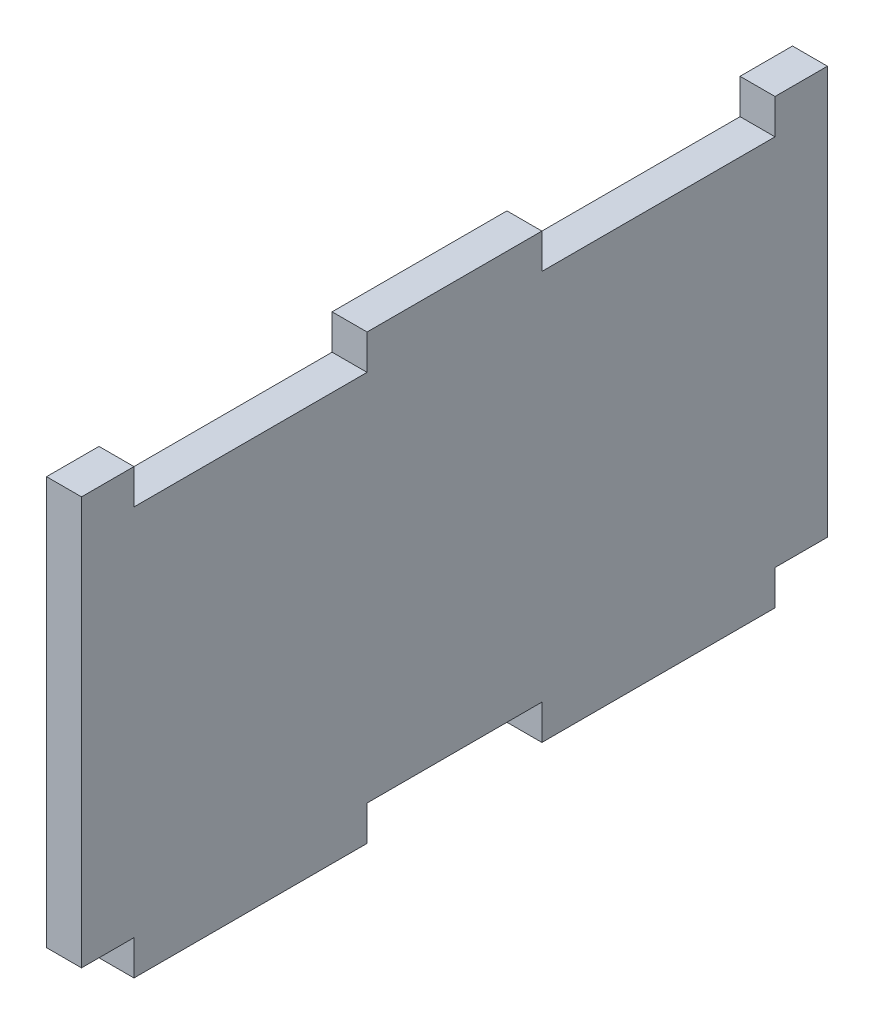
ISO-10303-21;
HEADER;
FILE_DESCRIPTION(('STEP AP214'),'2;1');
FILE_NAME('part.step','',(''),(''),'','','');
FILE_SCHEMA(('AUTOMOTIVE_DESIGN { 1 0 10303 214 1 1 1 1 }'));
ENDSEC;
DATA;
#1=APPLICATION_CONTEXT('core data for automotive mechanical design processes');
#2=APPLICATION_PROTOCOL_DEFINITION('international standard','automotive_design',2000,#1);
#3=PRODUCT_CONTEXT('',#1,'mechanical');
#4=PRODUCT('Part','Part','',(#3));
#5=PRODUCT_RELATED_PRODUCT_CATEGORY('part','',(#4));
#6=PRODUCT_DEFINITION_FORMATION('','',#4);
#7=PRODUCT_DEFINITION_CONTEXT('part definition',#1,'design');
#8=PRODUCT_DEFINITION('design','',#6,#7);
#9=PRODUCT_DEFINITION_SHAPE('','',#8);
#10=(LENGTH_UNIT() NAMED_UNIT(*) SI_UNIT(.MILLI.,.METRE.));
#11=(NAMED_UNIT(*) PLANE_ANGLE_UNIT() SI_UNIT($,.RADIAN.));
#12=(NAMED_UNIT(*) SI_UNIT($,.STERADIAN.) SOLID_ANGLE_UNIT());
#13=UNCERTAINTY_MEASURE_WITH_UNIT(LENGTH_MEASURE(1.E-05),#10,'distance_accuracy_value','');
#14=(GEOMETRIC_REPRESENTATION_CONTEXT(3) GLOBAL_UNCERTAINTY_ASSIGNED_CONTEXT((#13)) GLOBAL_UNIT_ASSIGNED_CONTEXT((#10,
#11,#12)) REPRESENTATION_CONTEXT('',''));
#15=CARTESIAN_POINT('',(0.,0.,0.));
#16=DIRECTION('',(0.,0.,1.));
#17=DIRECTION('',(1.,0.,0.));
#18=AXIS2_PLACEMENT_3D('',#15,#16,#17);
#19=CARTESIAN_POINT('',(3.,0.,0.));
#20=DIRECTION('',(0.,0.,1.));
#21=DIRECTION('',(1.,0.,0.));
#22=AXIS2_PLACEMENT_3D('',#19,#20,#21);
#23=PLANE('',#22);
#24=DIRECTION('',(0.,1.,0.));
#25=VECTOR('',#24,1.);
#26=CARTESIAN_POINT('',(0.,0.,0.));
#27=LINE('',#26,#25);
#28=CARTESIAN_POINT('',(0.,0.,0.));
#29=VERTEX_POINT('',#28);
#30=CARTESIAN_POINT('',(0.,35.,0.));
#31=VERTEX_POINT('',#30);
#32=EDGE_CURVE('E206',#29,#31,#27,.T.);
#33=ORIENTED_EDGE('',*,*,#32,.F.);
#34=DIRECTION('',(-1.,0.,0.));
#35=VECTOR('',#34,1.);
#36=CARTESIAN_POINT('',(3.,0.,0.));
#37=LINE('',#36,#35);
#38=CARTESIAN_POINT('',(3.,0.,0.));
#39=VERTEX_POINT('',#38);
#40=EDGE_CURVE('E42',#39,#29,#37,.T.);
#41=ORIENTED_EDGE('',*,*,#40,.F.);
#42=DIRECTION('',(0.,1.,0.));
#43=VECTOR('',#42,1.);
#44=CARTESIAN_POINT('',(3.,0.,0.));
#45=LINE('',#44,#43);
#46=CARTESIAN_POINT('',(3.,35.,0.));
#47=VERTEX_POINT('',#46);
#48=EDGE_CURVE('E257',#39,#47,#45,.T.);
#49=ORIENTED_EDGE('',*,*,#48,.T.);
#50=DIRECTION('',(-1.,0.,0.));
#51=VECTOR('',#50,1.);
#52=CARTESIAN_POINT('',(3.,35.,0.));
#53=LINE('',#52,#51);
#54=EDGE_CURVE('E124',#47,#31,#53,.T.);
#55=ORIENTED_EDGE('',*,*,#54,.T.);
#56=EDGE_LOOP('',(#33,#41,#49,#55));
#57=FACE_BOUND('',#56,.T.);
#58=ADVANCED_FACE('F35',(#57),#23,.T.);
#59=CARTESIAN_POINT('',(3.,0.,0.));
#60=DIRECTION('',(0.,1.,0.));
#61=DIRECTION('',(0.,0.,1.));
#62=AXIS2_PLACEMENT_3D('',#59,#60,#61);
#63=PLANE('',#62);
#64=DIRECTION('',(0.,0.,-1.));
#65=VECTOR('',#64,1.);
#66=CARTESIAN_POINT('',(0.,0.,0.));
#67=LINE('',#66,#65);
#68=CARTESIAN_POINT('',(0.,0.,-4.5));
#69=VERTEX_POINT('',#68);
#70=EDGE_CURVE('E255',#29,#69,#67,.T.);
#71=ORIENTED_EDGE('',*,*,#70,.T.);
#72=DIRECTION('',(-1.,0.,0.));
#73=VECTOR('',#72,1.);
#74=CARTESIAN_POINT('',(3.,0.,-4.5));
#75=LINE('',#74,#73);
#76=CARTESIAN_POINT('',(3.,0.,-4.5));
#77=VERTEX_POINT('',#76);
#78=EDGE_CURVE('E194',#77,#69,#75,.T.);
#79=ORIENTED_EDGE('',*,*,#78,.F.);
#80=DIRECTION('',(0.,0.,-1.));
#81=VECTOR('',#80,1.);
#82=CARTESIAN_POINT('',(3.,0.,0.));
#83=LINE('',#82,#81);
#84=EDGE_CURVE('E181',#39,#77,#83,.T.);
#85=ORIENTED_EDGE('',*,*,#84,.F.);
#86=ORIENTED_EDGE('',*,*,#40,.T.);
#87=EDGE_LOOP('',(#71,#79,#85,#86));
#88=FACE_BOUND('',#87,.T.);
#89=ADVANCED_FACE('F292',(#88),#63,.F.);
#90=CARTESIAN_POINT('',(3.,0.,-4.5));
#91=DIRECTION('',(0.,0.,-1.));
#92=DIRECTION('',(0.,1.,0.));
#93=AXIS2_PLACEMENT_3D('',#90,#91,#92);
#94=PLANE('',#93);
#95=DIRECTION('',(0.,-1.,0.));
#96=VECTOR('',#95,1.);
#97=CARTESIAN_POINT('',(0.,0.,-4.5));
#98=LINE('',#97,#96);
#99=CARTESIAN_POINT('',(0.,-3.,-4.50000000000001));
#100=VERTEX_POINT('',#99);
#101=EDGE_CURVE('E190',#69,#100,#98,.T.);
#102=ORIENTED_EDGE('',*,*,#101,.T.);
#103=DIRECTION('',(-1.,0.,0.));
#104=VECTOR('',#103,1.);
#105=CARTESIAN_POINT('',(3.,-3.,-4.50000000000001));
#106=LINE('',#105,#104);
#107=CARTESIAN_POINT('',(3.,-3.,-4.50000000000001));
#108=VERTEX_POINT('',#107);
#109=EDGE_CURVE('E187',#108,#100,#106,.T.);
#110=ORIENTED_EDGE('',*,*,#109,.F.);
#111=DIRECTION('',(0.,-1.,0.));
#112=VECTOR('',#111,1.);
#113=CARTESIAN_POINT('',(3.,0.,-4.5));
#114=LINE('',#113,#112);
#115=EDGE_CURVE('E172',#77,#108,#114,.T.);
#116=ORIENTED_EDGE('',*,*,#115,.F.);
#117=ORIENTED_EDGE('',*,*,#78,.T.);
#118=EDGE_LOOP('',(#102,#110,#116,#117));
#119=FACE_BOUND('',#118,.T.);
#120=ADVANCED_FACE('F188',(#119),#94,.F.);
#121=CARTESIAN_POINT('',(3.,-3.,-4.50000000000001));
#122=DIRECTION('',(0.,1.,0.));
#123=DIRECTION('',(0.,0.,1.));
#124=AXIS2_PLACEMENT_3D('',#121,#122,#123);
#125=PLANE('',#124);
#126=DIRECTION('',(0.,0.,-1.));
#127=VECTOR('',#126,1.);
#128=CARTESIAN_POINT('',(0.,-3.,-4.50000000000001));
#129=LINE('',#128,#127);
#130=CARTESIAN_POINT('',(0.,-3.,-24.5));
#131=VERTEX_POINT('',#130);
#132=EDGE_CURVE('E252',#100,#131,#129,.T.);
#133=ORIENTED_EDGE('',*,*,#132,.T.);
#134=DIRECTION('',(-1.,0.,0.));
#135=VECTOR('',#134,1.);
#136=CARTESIAN_POINT('',(3.,-3.,-24.5));
#137=LINE('',#136,#135);
#138=CARTESIAN_POINT('',(3.,-3.,-24.5));
#139=VERTEX_POINT('',#138);
#140=EDGE_CURVE('E195',#139,#131,#137,.T.);
#141=ORIENTED_EDGE('',*,*,#140,.F.);
#142=DIRECTION('',(0.,0.,-1.));
#143=VECTOR('',#142,1.);
#144=CARTESIAN_POINT('',(3.,-3.,-4.50000000000001));
#145=LINE('',#144,#143);
#146=EDGE_CURVE('E178',#108,#139,#145,.T.);
#147=ORIENTED_EDGE('',*,*,#146,.F.);
#148=ORIENTED_EDGE('',*,*,#109,.T.);
#149=EDGE_LOOP('',(#133,#141,#147,#148));
#150=FACE_BOUND('',#149,.T.);
#151=ADVANCED_FACE('F197',(#150),#125,.F.);
#152=CARTESIAN_POINT('',(3.,0.,-24.5));
#153=DIRECTION('',(0.,0.,-1.));
#154=DIRECTION('',(0.,1.,0.));
#155=AXIS2_PLACEMENT_3D('',#152,#153,#154);
#156=PLANE('',#155);
#157=DIRECTION('',(0.,-1.,0.));
#158=VECTOR('',#157,1.);
#159=CARTESIAN_POINT('',(0.,0.,-24.5));
#160=LINE('',#159,#158);
#161=CARTESIAN_POINT('',(0.,0.,-24.5));
#162=VERTEX_POINT('',#161);
#163=EDGE_CURVE('E249',#162,#131,#160,.T.);
#164=ORIENTED_EDGE('',*,*,#163,.F.);
#165=DIRECTION('',(-1.,0.,0.));
#166=VECTOR('',#165,1.);
#167=CARTESIAN_POINT('',(3.,0.,-24.5));
#168=LINE('',#167,#166);
#169=CARTESIAN_POINT('',(3.,0.,-24.5));
#170=VERTEX_POINT('',#169);
#171=EDGE_CURVE('E261',#170,#162,#168,.T.);
#172=ORIENTED_EDGE('',*,*,#171,.F.);
#173=DIRECTION('',(0.,-1.,0.));
#174=VECTOR('',#173,1.);
#175=CARTESIAN_POINT('',(3.,0.,-24.5));
#176=LINE('',#175,#174);
#177=EDGE_CURVE('E199',#170,#139,#176,.T.);
#178=ORIENTED_EDGE('',*,*,#177,.T.);
#179=ORIENTED_EDGE('',*,*,#140,.T.);
#180=EDGE_LOOP('',(#164,#172,#178,#179));
#181=FACE_BOUND('',#180,.T.);
#182=ADVANCED_FACE('F417',(#181),#156,.T.);
#183=CARTESIAN_POINT('',(3.,0.,-24.5));
#184=DIRECTION('',(0.,1.,0.));
#185=DIRECTION('',(0.,0.,1.));
#186=AXIS2_PLACEMENT_3D('',#183,#184,#185);
#187=PLANE('',#186);
#188=DIRECTION('',(0.,0.,-1.));
#189=VECTOR('',#188,1.);
#190=CARTESIAN_POINT('',(0.,0.,-24.5));
#191=LINE('',#190,#189);
#192=CARTESIAN_POINT('',(0.,0.,-39.5));
#193=VERTEX_POINT('',#192);
#194=EDGE_CURVE('E247',#162,#193,#191,.T.);
#195=ORIENTED_EDGE('',*,*,#194,.T.);
#196=DIRECTION('',(-1.,0.,0.));
#197=VECTOR('',#196,1.);
#198=CARTESIAN_POINT('',(3.,0.,-39.5));
#199=LINE('',#198,#197);
#200=CARTESIAN_POINT('',(3.,0.,-39.5));
#201=VERTEX_POINT('',#200);
#202=EDGE_CURVE('E263',#201,#193,#199,.T.);
#203=ORIENTED_EDGE('',*,*,#202,.F.);
#204=DIRECTION('',(0.,0.,-1.));
#205=VECTOR('',#204,1.);
#206=CARTESIAN_POINT('',(3.,0.,-24.5));
#207=LINE('',#206,#205);
#208=EDGE_CURVE('E201',#170,#201,#207,.T.);
#209=ORIENTED_EDGE('',*,*,#208,.F.);
#210=ORIENTED_EDGE('',*,*,#171,.T.);
#211=EDGE_LOOP('',(#195,#203,#209,#210));
#212=FACE_BOUND('',#211,.T.);
#213=ADVANCED_FACE('F335',(#212),#187,.F.);
#214=CARTESIAN_POINT('',(3.,0.,-39.5));
#215=DIRECTION('',(0.,0.,-1.));
#216=DIRECTION('',(0.,1.,0.));
#217=AXIS2_PLACEMENT_3D('',#214,#215,#216);
#218=PLANE('',#217);
#219=DIRECTION('',(0.,-1.,0.));
#220=VECTOR('',#219,1.);
#221=CARTESIAN_POINT('',(0.,0.,-39.5));
#222=LINE('',#221,#220);
#223=CARTESIAN_POINT('',(0.,-3.,-39.5));
#224=VERTEX_POINT('',#223);
#225=EDGE_CURVE('E245',#193,#224,#222,.T.);
#226=ORIENTED_EDGE('',*,*,#225,.T.);
#227=DIRECTION('',(-1.,0.,0.));
#228=VECTOR('',#227,1.);
#229=CARTESIAN_POINT('',(3.,-3.,-39.5));
#230=LINE('',#229,#228);
#231=CARTESIAN_POINT('',(3.,-3.,-39.5));
#232=VERTEX_POINT('',#231);
#233=EDGE_CURVE('E266',#232,#224,#230,.T.);
#234=ORIENTED_EDGE('',*,*,#233,.F.);
#235=DIRECTION('',(0.,-1.,0.));
#236=VECTOR('',#235,1.);
#237=CARTESIAN_POINT('',(3.,0.,-39.5));
#238=LINE('',#237,#236);
#239=EDGE_CURVE('E329',#201,#232,#238,.T.);
#240=ORIENTED_EDGE('',*,*,#239,.F.);
#241=ORIENTED_EDGE('',*,*,#202,.T.);
#242=EDGE_LOOP('',(#226,#234,#240,#241));
#243=FACE_BOUND('',#242,.T.);
#244=ADVANCED_FACE('F339',(#243),#218,.F.);
#245=CARTESIAN_POINT('',(3.,-3.,-39.5));
#246=DIRECTION('',(0.,1.,0.));
#247=DIRECTION('',(0.,0.,1.));
#248=AXIS2_PLACEMENT_3D('',#245,#246,#247);
#249=PLANE('',#248);
#250=DIRECTION('',(0.,0.,-1.));
#251=VECTOR('',#250,1.);
#252=CARTESIAN_POINT('',(0.,-3.,-39.5));
#253=LINE('',#252,#251);
#254=CARTESIAN_POINT('',(0.,-3.,-59.5));
#255=VERTEX_POINT('',#254);
#256=EDGE_CURVE('E242',#224,#255,#253,.T.);
#257=ORIENTED_EDGE('',*,*,#256,.T.);
#258=DIRECTION('',(-1.,0.,0.));
#259=VECTOR('',#258,1.);
#260=CARTESIAN_POINT('',(3.,-3.,-59.5));
#261=LINE('',#260,#259);
#262=CARTESIAN_POINT('',(3.,-3.,-59.5));
#263=VERTEX_POINT('',#262);
#264=EDGE_CURVE('E269',#263,#255,#261,.T.);
#265=ORIENTED_EDGE('',*,*,#264,.F.);
#266=DIRECTION('',(0.,0.,-1.));
#267=VECTOR('',#266,1.);
#268=CARTESIAN_POINT('',(3.,-3.,-39.5));
#269=LINE('',#268,#267);
#270=EDGE_CURVE('E327',#232,#263,#269,.T.);
#271=ORIENTED_EDGE('',*,*,#270,.F.);
#272=ORIENTED_EDGE('',*,*,#233,.T.);
#273=EDGE_LOOP('',(#257,#265,#271,#272));
#274=FACE_BOUND('',#273,.T.);
#275=ADVANCED_FACE('F344',(#274),#249,.F.);
#276=CARTESIAN_POINT('',(3.,0.,-59.5));
#277=DIRECTION('',(0.,0.,-1.));
#278=DIRECTION('',(0.,1.,0.));
#279=AXIS2_PLACEMENT_3D('',#276,#277,#278);
#280=PLANE('',#279);
#281=DIRECTION('',(0.,-1.,0.));
#282=VECTOR('',#281,1.);
#283=CARTESIAN_POINT('',(0.,0.,-59.5));
#284=LINE('',#283,#282);
#285=CARTESIAN_POINT('',(0.,0.,-59.5));
#286=VERTEX_POINT('',#285);
#287=EDGE_CURVE('E239',#286,#255,#284,.T.);
#288=ORIENTED_EDGE('',*,*,#287,.F.);
#289=DIRECTION('',(-1.,0.,0.));
#290=VECTOR('',#289,1.);
#291=CARTESIAN_POINT('',(3.,0.,-59.5));
#292=LINE('',#291,#290);
#293=CARTESIAN_POINT('',(3.,0.,-59.5));
#294=VERTEX_POINT('',#293);
#295=EDGE_CURVE('E271',#294,#286,#292,.T.);
#296=ORIENTED_EDGE('',*,*,#295,.F.);
#297=DIRECTION('',(0.,-1.,0.));
#298=VECTOR('',#297,1.);
#299=CARTESIAN_POINT('',(3.,0.,-59.5));
#300=LINE('',#299,#298);
#301=EDGE_CURVE('E324',#294,#263,#300,.T.);
#302=ORIENTED_EDGE('',*,*,#301,.T.);
#303=ORIENTED_EDGE('',*,*,#264,.T.);
#304=EDGE_LOOP('',(#288,#296,#302,#303));
#305=FACE_BOUND('',#304,.T.);
#306=ADVANCED_FACE('F351',(#305),#280,.T.);
#307=CARTESIAN_POINT('',(3.,0.,-59.5));
#308=DIRECTION('',(0.,1.,0.));
#309=DIRECTION('',(0.,0.,1.));
#310=AXIS2_PLACEMENT_3D('',#307,#308,#309);
#311=PLANE('',#310);
#312=DIRECTION('',(0.,0.,-1.));
#313=VECTOR('',#312,1.);
#314=CARTESIAN_POINT('',(0.,0.,-59.5));
#315=LINE('',#314,#313);
#316=CARTESIAN_POINT('',(0.,0.,-64.));
#317=VERTEX_POINT('',#316);
#318=EDGE_CURVE('E236',#286,#317,#315,.T.);
#319=ORIENTED_EDGE('',*,*,#318,.T.);
#320=DIRECTION('',(1.,0.,0.));
#321=VECTOR('',#320,1.);
#322=CARTESIAN_POINT('',(3.,0.,-64.));
#323=LINE('',#322,#321);
#324=CARTESIAN_POINT('',(3.,0.,-64.));
#325=VERTEX_POINT('',#324);
#326=EDGE_CURVE('E48',#317,#325,#323,.T.);
#327=ORIENTED_EDGE('',*,*,#326,.T.);
#328=DIRECTION('',(0.,0.,-1.));
#329=VECTOR('',#328,1.);
#330=CARTESIAN_POINT('',(3.,0.,-59.5));
#331=LINE('',#330,#329);
#332=EDGE_CURVE('E322',#294,#325,#331,.T.);
#333=ORIENTED_EDGE('',*,*,#332,.F.);
#334=ORIENTED_EDGE('',*,*,#295,.T.);
#335=EDGE_LOOP('',(#319,#327,#333,#334));
#336=FACE_BOUND('',#335,.T.);
#337=ADVANCED_FACE('F354',(#336),#311,.F.);
#338=CARTESIAN_POINT('',(3.,35.,-59.5));
#339=DIRECTION('',(0.,1.,0.));
#340=DIRECTION('',(0.,0.,1.));
#341=AXIS2_PLACEMENT_3D('',#338,#339,#340);
#342=PLANE('',#341);
#343=DIRECTION('',(1.,0.,0.));
#344=VECTOR('',#343,1.);
#345=CARTESIAN_POINT('',(3.,35.,-64.));
#346=LINE('',#345,#344);
#347=CARTESIAN_POINT('',(0.,35.,-64.));
#348=VERTEX_POINT('',#347);
#349=CARTESIAN_POINT('',(3.,35.,-64.));
#350=VERTEX_POINT('',#349);
#351=EDGE_CURVE('E356',#348,#350,#346,.T.);
#352=ORIENTED_EDGE('',*,*,#351,.F.);
#353=DIRECTION('',(0.,0.,-1.));
#354=VECTOR('',#353,1.);
#355=CARTESIAN_POINT('',(0.,35.,-59.5));
#356=LINE('',#355,#354);
#357=CARTESIAN_POINT('',(0.,35.,-59.5));
#358=VERTEX_POINT('',#357);
#359=EDGE_CURVE('E233',#358,#348,#356,.T.);
#360=ORIENTED_EDGE('',*,*,#359,.F.);
#361=DIRECTION('',(-1.,0.,0.));
#362=VECTOR('',#361,1.);
#363=CARTESIAN_POINT('',(3.,35.,-59.5));
#364=LINE('',#363,#362);
#365=CARTESIAN_POINT('',(3.,35.,-59.5));
#366=VERTEX_POINT('',#365);
#367=EDGE_CURVE('E273',#366,#358,#364,.T.);
#368=ORIENTED_EDGE('',*,*,#367,.F.);
#369=DIRECTION('',(0.,0.,-1.));
#370=VECTOR('',#369,1.);
#371=CARTESIAN_POINT('',(3.,35.,-59.5));
#372=LINE('',#371,#370);
#373=EDGE_CURVE('E319',#366,#350,#372,.T.);
#374=ORIENTED_EDGE('',*,*,#373,.T.);
#375=EDGE_LOOP('',(#352,#360,#368,#374));
#376=FACE_BOUND('',#375,.T.);
#377=ADVANCED_FACE('F365',(#376),#342,.T.);
#378=CARTESIAN_POINT('',(3.,35.,-59.5));
#379=DIRECTION('',(0.,0.,-1.));
#380=DIRECTION('',(0.,1.,0.));
#381=AXIS2_PLACEMENT_3D('',#378,#379,#380);
#382=PLANE('',#381);
#383=DIRECTION('',(0.,-1.,0.));
#384=VECTOR('',#383,1.);
#385=CARTESIAN_POINT('',(0.,35.,-59.5));
#386=LINE('',#385,#384);
#387=CARTESIAN_POINT('',(0.,32.,-59.5));
#388=VERTEX_POINT('',#387);
#389=EDGE_CURVE('E230',#358,#388,#386,.T.);
#390=ORIENTED_EDGE('',*,*,#389,.T.);
#391=DIRECTION('',(-1.,0.,0.));
#392=VECTOR('',#391,1.);
#393=CARTESIAN_POINT('',(3.,32.,-59.5));
#394=LINE('',#393,#392);
#395=CARTESIAN_POINT('',(3.,32.,-59.5));
#396=VERTEX_POINT('',#395);
#397=EDGE_CURVE('E275',#396,#388,#394,.T.);
#398=ORIENTED_EDGE('',*,*,#397,.F.);
#399=DIRECTION('',(0.,-1.,0.));
#400=VECTOR('',#399,1.);
#401=CARTESIAN_POINT('',(3.,35.,-59.5));
#402=LINE('',#401,#400);
#403=EDGE_CURVE('E317',#366,#396,#402,.T.);
#404=ORIENTED_EDGE('',*,*,#403,.F.);
#405=ORIENTED_EDGE('',*,*,#367,.T.);
#406=EDGE_LOOP('',(#390,#398,#404,#405));
#407=FACE_BOUND('',#406,.T.);
#408=ADVANCED_FACE('F371',(#407),#382,.F.);
#409=CARTESIAN_POINT('',(3.,32.,-39.5));
#410=DIRECTION('',(0.,1.,0.));
#411=DIRECTION('',(0.,0.,1.));
#412=AXIS2_PLACEMENT_3D('',#409,#410,#411);
#413=PLANE('',#412);
#414=DIRECTION('',(0.,0.,-1.));
#415=VECTOR('',#414,1.);
#416=CARTESIAN_POINT('',(0.,32.,-39.5));
#417=LINE('',#416,#415);
#418=CARTESIAN_POINT('',(0.,32.,-39.5));
#419=VERTEX_POINT('',#418);
#420=EDGE_CURVE('E227',#419,#388,#417,.T.);
#421=ORIENTED_EDGE('',*,*,#420,.F.);
#422=DIRECTION('',(-1.,0.,0.));
#423=VECTOR('',#422,1.);
#424=CARTESIAN_POINT('',(3.,32.,-39.5));
#425=LINE('',#424,#423);
#426=CARTESIAN_POINT('',(3.,32.,-39.5));
#427=VERTEX_POINT('',#426);
#428=EDGE_CURVE('E277',#427,#419,#425,.T.);
#429=ORIENTED_EDGE('',*,*,#428,.F.);
#430=DIRECTION('',(0.,0.,-1.));
#431=VECTOR('',#430,1.);
#432=CARTESIAN_POINT('',(3.,32.,-39.5));
#433=LINE('',#432,#431);
#434=EDGE_CURVE('E314',#427,#396,#433,.T.);
#435=ORIENTED_EDGE('',*,*,#434,.T.);
#436=ORIENTED_EDGE('',*,*,#397,.T.);
#437=EDGE_LOOP('',(#421,#429,#435,#436));
#438=FACE_BOUND('',#437,.T.);
#439=ADVANCED_FACE('F394',(#438),#413,.T.);
#440=CARTESIAN_POINT('',(3.,35.,-39.5));
#441=DIRECTION('',(0.,0.,-1.));
#442=DIRECTION('',(0.,1.,0.));
#443=AXIS2_PLACEMENT_3D('',#440,#441,#442);
#444=PLANE('',#443);
#445=DIRECTION('',(0.,-1.,0.));
#446=VECTOR('',#445,1.);
#447=CARTESIAN_POINT('',(0.,35.,-39.5));
#448=LINE('',#447,#446);
#449=CARTESIAN_POINT('',(0.,35.,-39.5));
#450=VERTEX_POINT('',#449);
#451=EDGE_CURVE('E224',#450,#419,#448,.T.);
#452=ORIENTED_EDGE('',*,*,#451,.F.);
#453=DIRECTION('',(-1.,0.,0.));
#454=VECTOR('',#453,1.);
#455=CARTESIAN_POINT('',(3.,35.,-39.5));
#456=LINE('',#455,#454);
#457=CARTESIAN_POINT('',(3.,35.,-39.5));
#458=VERTEX_POINT('',#457);
#459=EDGE_CURVE('E279',#458,#450,#456,.T.);
#460=ORIENTED_EDGE('',*,*,#459,.F.);
#461=DIRECTION('',(0.,-1.,0.));
#462=VECTOR('',#461,1.);
#463=CARTESIAN_POINT('',(3.,35.,-39.5));
#464=LINE('',#463,#462);
#465=EDGE_CURVE('E311',#458,#427,#464,.T.);
#466=ORIENTED_EDGE('',*,*,#465,.T.);
#467=ORIENTED_EDGE('',*,*,#428,.T.);
#468=EDGE_LOOP('',(#452,#460,#466,#467));
#469=FACE_BOUND('',#468,.T.);
#470=ADVANCED_FACE('F378',(#469),#444,.T.);
#471=CARTESIAN_POINT('',(3.,35.,-24.5));
#472=DIRECTION('',(0.,1.,0.));
#473=DIRECTION('',(0.,0.,1.));
#474=AXIS2_PLACEMENT_3D('',#471,#472,#473);
#475=PLANE('',#474);
#476=DIRECTION('',(0.,0.,-1.));
#477=VECTOR('',#476,1.);
#478=CARTESIAN_POINT('',(0.,35.,-24.5));
#479=LINE('',#478,#477);
#480=CARTESIAN_POINT('',(0.,35.,-24.5));
#481=VERTEX_POINT('',#480);
#482=EDGE_CURVE('E221',#481,#450,#479,.T.);
#483=ORIENTED_EDGE('',*,*,#482,.F.);
#484=DIRECTION('',(-1.,0.,0.));
#485=VECTOR('',#484,1.);
#486=CARTESIAN_POINT('',(3.,35.,-24.5));
#487=LINE('',#486,#485);
#488=CARTESIAN_POINT('',(3.,35.,-24.5));
#489=VERTEX_POINT('',#488);
#490=EDGE_CURVE('E281',#489,#481,#487,.T.);
#491=ORIENTED_EDGE('',*,*,#490,.F.);
#492=DIRECTION('',(0.,0.,-1.));
#493=VECTOR('',#492,1.);
#494=CARTESIAN_POINT('',(3.,35.,-24.5));
#495=LINE('',#494,#493);
#496=EDGE_CURVE('E308',#489,#458,#495,.T.);
#497=ORIENTED_EDGE('',*,*,#496,.T.);
#498=ORIENTED_EDGE('',*,*,#459,.T.);
#499=EDGE_LOOP('',(#483,#491,#497,#498));
#500=FACE_BOUND('',#499,.T.);
#501=ADVANCED_FACE('F382',(#500),#475,.T.);
#502=CARTESIAN_POINT('',(3.,35.,-24.5));
#503=DIRECTION('',(0.,0.,-1.));
#504=DIRECTION('',(0.,1.,0.));
#505=AXIS2_PLACEMENT_3D('',#502,#503,#504);
#506=PLANE('',#505);
#507=DIRECTION('',(0.,-1.,0.));
#508=VECTOR('',#507,1.);
#509=CARTESIAN_POINT('',(0.,35.,-24.5));
#510=LINE('',#509,#508);
#511=CARTESIAN_POINT('',(0.,32.,-24.5));
#512=VERTEX_POINT('',#511);
#513=EDGE_CURVE('E218',#481,#512,#510,.T.);
#514=ORIENTED_EDGE('',*,*,#513,.T.);
#515=DIRECTION('',(-1.,0.,0.));
#516=VECTOR('',#515,1.);
#517=CARTESIAN_POINT('',(3.,32.,-24.5));
#518=LINE('',#517,#516);
#519=CARTESIAN_POINT('',(3.,32.,-24.5));
#520=VERTEX_POINT('',#519);
#521=EDGE_CURVE('E283',#520,#512,#518,.T.);
#522=ORIENTED_EDGE('',*,*,#521,.F.);
#523=DIRECTION('',(0.,-1.,0.));
#524=VECTOR('',#523,1.);
#525=CARTESIAN_POINT('',(3.,35.,-24.5));
#526=LINE('',#525,#524);
#527=EDGE_CURVE('E306',#489,#520,#526,.T.);
#528=ORIENTED_EDGE('',*,*,#527,.F.);
#529=ORIENTED_EDGE('',*,*,#490,.T.);
#530=EDGE_LOOP('',(#514,#522,#528,#529));
#531=FACE_BOUND('',#530,.T.);
#532=ADVANCED_FACE('F387',(#531),#506,.F.);
#533=CARTESIAN_POINT('',(3.,32.,-4.5));
#534=DIRECTION('',(0.,1.,0.));
#535=DIRECTION('',(0.,0.,1.));
#536=AXIS2_PLACEMENT_3D('',#533,#534,#535);
#537=PLANE('',#536);
#538=DIRECTION('',(0.,0.,-1.));
#539=VECTOR('',#538,1.);
#540=CARTESIAN_POINT('',(0.,32.,-4.5));
#541=LINE('',#540,#539);
#542=CARTESIAN_POINT('',(0.,32.,-4.5));
#543=VERTEX_POINT('',#542);
#544=EDGE_CURVE('E215',#543,#512,#541,.T.);
#545=ORIENTED_EDGE('',*,*,#544,.F.);
#546=DIRECTION('',(-1.,0.,0.));
#547=VECTOR('',#546,1.);
#548=CARTESIAN_POINT('',(3.,32.,-4.5));
#549=LINE('',#548,#547);
#550=CARTESIAN_POINT('',(3.,32.,-4.5));
#551=VERTEX_POINT('',#550);
#552=EDGE_CURVE('E285',#551,#543,#549,.T.);
#553=ORIENTED_EDGE('',*,*,#552,.F.);
#554=DIRECTION('',(0.,0.,-1.));
#555=VECTOR('',#554,1.);
#556=CARTESIAN_POINT('',(3.,32.,-4.5));
#557=LINE('',#556,#555);
#558=EDGE_CURVE('E303',#551,#520,#557,.T.);
#559=ORIENTED_EDGE('',*,*,#558,.T.);
#560=ORIENTED_EDGE('',*,*,#521,.T.);
#561=EDGE_LOOP('',(#545,#553,#559,#560));
#562=FACE_BOUND('',#561,.T.);
#563=ADVANCED_FACE('F391',(#562),#537,.T.);
#564=CARTESIAN_POINT('',(3.,35.,-4.5));
#565=DIRECTION('',(0.,0.,-1.));
#566=DIRECTION('',(0.,1.,0.));
#567=AXIS2_PLACEMENT_3D('',#564,#565,#566);
#568=PLANE('',#567);
#569=DIRECTION('',(0.,-1.,0.));
#570=VECTOR('',#569,1.);
#571=CARTESIAN_POINT('',(0.,35.,-4.5));
#572=LINE('',#571,#570);
#573=CARTESIAN_POINT('',(0.,35.,-4.5));
#574=VERTEX_POINT('',#573);
#575=EDGE_CURVE('E212',#574,#543,#572,.T.);
#576=ORIENTED_EDGE('',*,*,#575,.F.);
#577=DIRECTION('',(-1.,0.,0.));
#578=VECTOR('',#577,1.);
#579=CARTESIAN_POINT('',(3.,35.,-4.5));
#580=LINE('',#579,#578);
#581=CARTESIAN_POINT('',(3.,35.,-4.5));
#582=VERTEX_POINT('',#581);
#583=EDGE_CURVE('E287',#582,#574,#580,.T.);
#584=ORIENTED_EDGE('',*,*,#583,.F.);
#585=DIRECTION('',(0.,-1.,0.));
#586=VECTOR('',#585,1.);
#587=CARTESIAN_POINT('',(3.,35.,-4.5));
#588=LINE('',#587,#586);
#589=EDGE_CURVE('E296',#582,#551,#588,.T.);
#590=ORIENTED_EDGE('',*,*,#589,.T.);
#591=ORIENTED_EDGE('',*,*,#552,.T.);
#592=EDGE_LOOP('',(#576,#584,#590,#591));
#593=FACE_BOUND('',#592,.T.);
#594=ADVANCED_FACE('F393',(#593),#568,.T.);
#595=CARTESIAN_POINT('',(3.,35.,0.));
#596=DIRECTION('',(0.,1.,0.));
#597=DIRECTION('',(0.,0.,1.));
#598=AXIS2_PLACEMENT_3D('',#595,#596,#597);
#599=PLANE('',#598);
#600=DIRECTION('',(0.,0.,-1.));
#601=VECTOR('',#600,1.);
#602=CARTESIAN_POINT('',(0.,35.,0.));
#603=LINE('',#602,#601);
#604=EDGE_CURVE('E209',#31,#574,#603,.T.);
#605=ORIENTED_EDGE('',*,*,#604,.F.);
#606=ORIENTED_EDGE('',*,*,#54,.F.);
#607=DIRECTION('',(0.,0.,-1.));
#608=VECTOR('',#607,1.);
#609=CARTESIAN_POINT('',(3.,35.,0.));
#610=LINE('',#609,#608);
#611=EDGE_CURVE('E294',#47,#582,#610,.T.);
#612=ORIENTED_EDGE('',*,*,#611,.T.);
#613=ORIENTED_EDGE('',*,*,#583,.T.);
#614=EDGE_LOOP('',(#605,#606,#612,#613));
#615=FACE_BOUND('',#614,.T.);
#616=ADVANCED_FACE('F288',(#615),#599,.T.);
#617=CARTESIAN_POINT('',(3.,0.,0.));
#618=DIRECTION('',(-1.,0.,0.));
#619=DIRECTION('',(0.,0.,1.));
#620=AXIS2_PLACEMENT_3D('',#617,#618,#619);
#621=PLANE('',#620);
#622=ORIENTED_EDGE('',*,*,#332,.T.);
#623=DIRECTION('',(0.,-1.,0.));
#624=VECTOR('',#623,1.);
#625=CARTESIAN_POINT('',(3.,40.,-64.));
#626=LINE('',#625,#624);
#627=EDGE_CURVE('E358',#350,#325,#626,.T.);
#628=ORIENTED_EDGE('',*,*,#627,.F.);
#629=ORIENTED_EDGE('',*,*,#373,.F.);
#630=ORIENTED_EDGE('',*,*,#403,.T.);
#631=ORIENTED_EDGE('',*,*,#434,.F.);
#632=ORIENTED_EDGE('',*,*,#465,.F.);
#633=ORIENTED_EDGE('',*,*,#496,.F.);
#634=ORIENTED_EDGE('',*,*,#527,.T.);
#635=ORIENTED_EDGE('',*,*,#558,.F.);
#636=ORIENTED_EDGE('',*,*,#589,.F.);
#637=ORIENTED_EDGE('',*,*,#611,.F.);
#638=ORIENTED_EDGE('',*,*,#48,.F.);
#639=ORIENTED_EDGE('',*,*,#84,.T.);
#640=ORIENTED_EDGE('',*,*,#115,.T.);
#641=ORIENTED_EDGE('',*,*,#146,.T.);
#642=ORIENTED_EDGE('',*,*,#177,.F.);
#643=ORIENTED_EDGE('',*,*,#208,.T.);
#644=ORIENTED_EDGE('',*,*,#239,.T.);
#645=ORIENTED_EDGE('',*,*,#270,.T.);
#646=ORIENTED_EDGE('',*,*,#301,.F.);
#647=EDGE_LOOP('',(#622,#628,#629,#630,#631,#632,#633,#634,#635,#636,#637,#638,#639,#640,#641,
#642,#643,#644,#645,#646));
#648=FACE_BOUND('',#647,.T.);
#649=ADVANCED_FACE('F175',(#648),#621,.F.);
#650=CARTESIAN_POINT('',(0.,0.,0.));
#651=DIRECTION('',(-1.,0.,0.));
#652=DIRECTION('',(0.,0.,1.));
#653=AXIS2_PLACEMENT_3D('',#650,#651,#652);
#654=PLANE('',#653);
#655=DIRECTION('',(0.,1.,0.));
#656=VECTOR('',#655,1.);
#657=CARTESIAN_POINT('',(0.,0.,-64.));
#658=LINE('',#657,#656);
#659=EDGE_CURVE('E11',#317,#348,#658,.T.);
#660=ORIENTED_EDGE('',*,*,#659,.F.);
#661=ORIENTED_EDGE('',*,*,#318,.F.);
#662=ORIENTED_EDGE('',*,*,#287,.T.);
#663=ORIENTED_EDGE('',*,*,#256,.F.);
#664=ORIENTED_EDGE('',*,*,#225,.F.);
#665=ORIENTED_EDGE('',*,*,#194,.F.);
#666=ORIENTED_EDGE('',*,*,#163,.T.);
#667=ORIENTED_EDGE('',*,*,#132,.F.);
#668=ORIENTED_EDGE('',*,*,#101,.F.);
#669=ORIENTED_EDGE('',*,*,#70,.F.);
#670=ORIENTED_EDGE('',*,*,#32,.T.);
#671=ORIENTED_EDGE('',*,*,#604,.T.);
#672=ORIENTED_EDGE('',*,*,#575,.T.);
#673=ORIENTED_EDGE('',*,*,#544,.T.);
#674=ORIENTED_EDGE('',*,*,#513,.F.);
#675=ORIENTED_EDGE('',*,*,#482,.T.);
#676=ORIENTED_EDGE('',*,*,#451,.T.);
#677=ORIENTED_EDGE('',*,*,#420,.T.);
#678=ORIENTED_EDGE('',*,*,#389,.F.);
#679=ORIENTED_EDGE('',*,*,#359,.T.);
#680=EDGE_LOOP('',(#660,#661,#662,#663,#664,#665,#666,#667,#668,#669,#670,#671,#672,#673,#674,
#675,#676,#677,#678,#679));
#681=FACE_BOUND('',#680,.T.);
#682=ADVANCED_FACE('F291',(#681),#654,.T.);
#683=CARTESIAN_POINT('',(-7.,40.,-64.));
#684=DIRECTION('',(0.,0.,1.));
#685=DIRECTION('',(1.,0.,0.));
#686=AXIS2_PLACEMENT_3D('',#683,#684,#685);
#687=PLANE('',#686);
#688=ORIENTED_EDGE('',*,*,#659,.T.);
#689=ORIENTED_EDGE('',*,*,#351,.T.);
#690=ORIENTED_EDGE('',*,*,#627,.T.);
#691=ORIENTED_EDGE('',*,*,#326,.F.);
#692=EDGE_LOOP('',(#688,#689,#690,#691));
#693=FACE_BOUND('',#692,.T.);
#694=ADVANCED_FACE('F361',(#693),#687,.F.);
#695=CLOSED_SHELL('',(#58,#89,#120,#151,#182,#213,#244,#275,#306,#337,#377,#408,#439,#470,#501,
#532,#563,#594,#616,#649,#682,#694));
#696=MANIFOLD_SOLID_BREP('B2',#695);
#697=ADVANCED_BREP_SHAPE_REPRESENTATION('',(#18,#696),#14);
#698=SHAPE_DEFINITION_REPRESENTATION(#9,#697);
ENDSEC;
END-ISO-10303-21;
